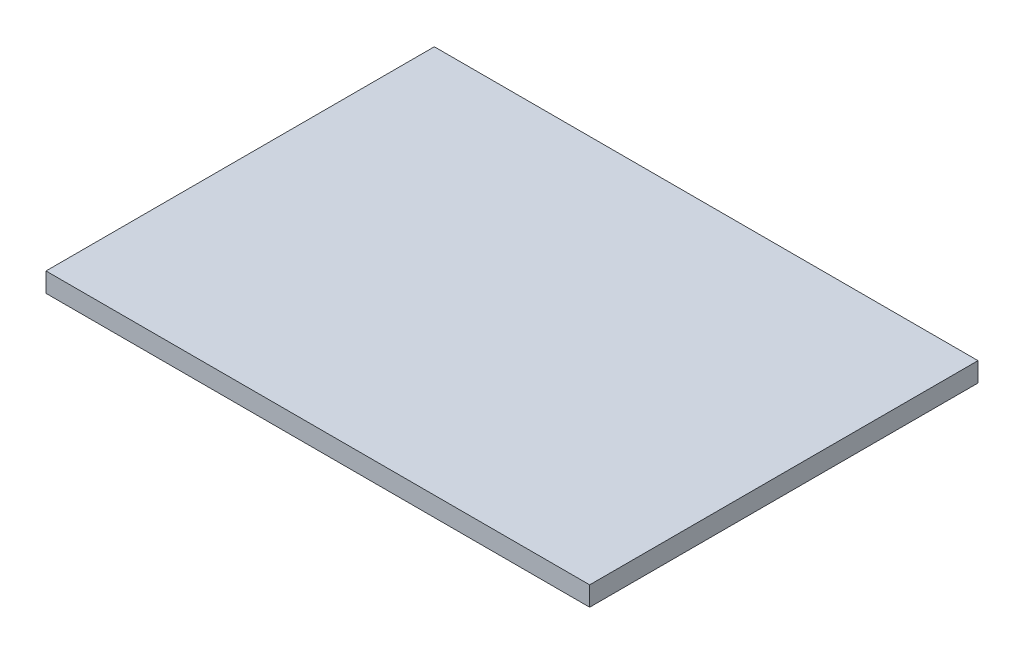
ISO-10303-21;
HEADER;
FILE_DESCRIPTION(('STEP AP214'),'2;1');
FILE_NAME('part.step','',(''),(''),'','','');
FILE_SCHEMA(('AUTOMOTIVE_DESIGN { 1 0 10303 214 1 1 1 1 }'));
ENDSEC;
DATA;
#1=APPLICATION_CONTEXT('core data for automotive mechanical design processes');
#2=APPLICATION_PROTOCOL_DEFINITION('international standard','automotive_design',2000,#1);
#3=PRODUCT_CONTEXT('',#1,'mechanical');
#4=PRODUCT('Part','Part','',(#3));
#5=PRODUCT_RELATED_PRODUCT_CATEGORY('part','',(#4));
#6=PRODUCT_DEFINITION_FORMATION('','',#4);
#7=PRODUCT_DEFINITION_CONTEXT('part definition',#1,'design');
#8=PRODUCT_DEFINITION('design','',#6,#7);
#9=PRODUCT_DEFINITION_SHAPE('','',#8);
#10=(LENGTH_UNIT() NAMED_UNIT(*) SI_UNIT(.MILLI.,.METRE.));
#11=(NAMED_UNIT(*) PLANE_ANGLE_UNIT() SI_UNIT($,.RADIAN.));
#12=(NAMED_UNIT(*) SI_UNIT($,.STERADIAN.) SOLID_ANGLE_UNIT());
#13=UNCERTAINTY_MEASURE_WITH_UNIT(LENGTH_MEASURE(1.E-05),#10,'distance_accuracy_value','');
#14=(GEOMETRIC_REPRESENTATION_CONTEXT(3) GLOBAL_UNCERTAINTY_ASSIGNED_CONTEXT((#13)) GLOBAL_UNIT_ASSIGNED_CONTEXT((#10,
#11,#12)) REPRESENTATION_CONTEXT('',''));
#15=CARTESIAN_POINT('',(0.,0.,0.));
#16=DIRECTION('',(0.,0.,1.));
#17=DIRECTION('',(1.,0.,0.));
#18=AXIS2_PLACEMENT_3D('',#15,#16,#17);
#19=CARTESIAN_POINT('',(177.8,12.7,-127.));
#20=DIRECTION('',(-1.,0.,0.));
#21=DIRECTION('',(0.,0.,1.));
#22=AXIS2_PLACEMENT_3D('',#19,#20,#21);
#23=PLANE('',#22);
#24=DIRECTION('',(0.,0.,-1.));
#25=VECTOR('',#24,1.);
#26=CARTESIAN_POINT('',(177.8,0.,-127.));
#27=LINE('',#26,#25);
#28=CARTESIAN_POINT('',(177.8,0.,127.));
#29=VERTEX_POINT('',#28);
#30=CARTESIAN_POINT('',(177.8,0.,-127.));
#31=VERTEX_POINT('',#30);
#32=EDGE_CURVE('E96',#29,#31,#27,.T.);
#33=ORIENTED_EDGE('',*,*,#32,.T.);
#34=DIRECTION('',(0.,-1.,0.));
#35=VECTOR('',#34,1.);
#36=CARTESIAN_POINT('',(177.8,12.7,-127.));
#37=LINE('',#36,#35);
#38=CARTESIAN_POINT('',(177.8,12.7,-127.));
#39=VERTEX_POINT('',#38);
#40=EDGE_CURVE('E11',#39,#31,#37,.T.);
#41=ORIENTED_EDGE('',*,*,#40,.F.);
#42=DIRECTION('',(0.,0.,-1.));
#43=VECTOR('',#42,1.);
#44=CARTESIAN_POINT('',(177.8,12.7,-127.));
#45=LINE('',#44,#43);
#46=CARTESIAN_POINT('',(177.8,12.7,127.));
#47=VERTEX_POINT('',#46);
#48=EDGE_CURVE('E84',#47,#39,#45,.T.);
#49=ORIENTED_EDGE('',*,*,#48,.F.);
#50=DIRECTION('',(0.,-1.,0.));
#51=VECTOR('',#50,1.);
#52=CARTESIAN_POINT('',(177.8,12.7,127.));
#53=LINE('',#52,#51);
#54=EDGE_CURVE('E92',#47,#29,#53,.T.);
#55=ORIENTED_EDGE('',*,*,#54,.T.);
#56=EDGE_LOOP('',(#33,#41,#49,#55));
#57=FACE_BOUND('',#56,.T.);
#58=ADVANCED_FACE('F33',(#57),#23,.F.);
#59=CARTESIAN_POINT('',(-177.8,12.7,-127.));
#60=DIRECTION('',(0.,0.,1.));
#61=DIRECTION('',(1.,0.,0.));
#62=AXIS2_PLACEMENT_3D('',#59,#60,#61);
#63=PLANE('',#62);
#64=DIRECTION('',(-1.,0.,0.));
#65=VECTOR('',#64,1.);
#66=CARTESIAN_POINT('',(-177.8,0.,-127.));
#67=LINE('',#66,#65);
#68=CARTESIAN_POINT('',(-177.8,0.,-127.));
#69=VERTEX_POINT('',#68);
#70=EDGE_CURVE('E88',#31,#69,#67,.T.);
#71=ORIENTED_EDGE('',*,*,#70,.T.);
#72=DIRECTION('',(0.,-1.,0.));
#73=VECTOR('',#72,1.);
#74=CARTESIAN_POINT('',(-177.8,12.7,-127.));
#75=LINE('',#74,#73);
#76=CARTESIAN_POINT('',(-177.8,12.7,-127.));
#77=VERTEX_POINT('',#76);
#78=EDGE_CURVE('E41',#77,#69,#75,.T.);
#79=ORIENTED_EDGE('',*,*,#78,.F.);
#80=DIRECTION('',(-1.,0.,0.));
#81=VECTOR('',#80,1.);
#82=CARTESIAN_POINT('',(-177.8,12.7,-127.));
#83=LINE('',#82,#81);
#84=EDGE_CURVE('E79',#39,#77,#83,.T.);
#85=ORIENTED_EDGE('',*,*,#84,.F.);
#86=ORIENTED_EDGE('',*,*,#40,.T.);
#87=EDGE_LOOP('',(#71,#79,#85,#86));
#88=FACE_BOUND('',#87,.T.);
#89=ADVANCED_FACE('F87',(#88),#63,.F.);
#90=CARTESIAN_POINT('',(-177.8,12.7,-127.));
#91=DIRECTION('',(1.,0.,0.));
#92=DIRECTION('',(0.,0.,-1.));
#93=AXIS2_PLACEMENT_3D('',#90,#91,#92);
#94=PLANE('',#93);
#95=DIRECTION('',(0.,0.,1.));
#96=VECTOR('',#95,1.);
#97=CARTESIAN_POINT('',(-177.8,0.,-127.));
#98=LINE('',#97,#96);
#99=CARTESIAN_POINT('',(-177.8,0.,127.));
#100=VERTEX_POINT('',#99);
#101=EDGE_CURVE('E66',#69,#100,#98,.T.);
#102=ORIENTED_EDGE('',*,*,#101,.T.);
#103=DIRECTION('',(0.,-1.,0.));
#104=VECTOR('',#103,1.);
#105=CARTESIAN_POINT('',(-177.8,12.7,127.));
#106=LINE('',#105,#104);
#107=CARTESIAN_POINT('',(-177.8,12.7,127.));
#108=VERTEX_POINT('',#107);
#109=EDGE_CURVE('E89',#108,#100,#106,.T.);
#110=ORIENTED_EDGE('',*,*,#109,.F.);
#111=DIRECTION('',(0.,0.,1.));
#112=VECTOR('',#111,1.);
#113=CARTESIAN_POINT('',(-177.8,12.7,-127.));
#114=LINE('',#113,#112);
#115=EDGE_CURVE('E82',#77,#108,#114,.T.);
#116=ORIENTED_EDGE('',*,*,#115,.F.);
#117=ORIENTED_EDGE('',*,*,#78,.T.);
#118=EDGE_LOOP('',(#102,#110,#116,#117));
#119=FACE_BOUND('',#118,.T.);
#120=ADVANCED_FACE('F90',(#119),#94,.F.);
#121=CARTESIAN_POINT('',(-177.8,12.7,127.));
#122=DIRECTION('',(0.,0.,-1.));
#123=DIRECTION('',(-1.,0.,0.));
#124=AXIS2_PLACEMENT_3D('',#121,#122,#123);
#125=PLANE('',#124);
#126=DIRECTION('',(1.,0.,0.));
#127=VECTOR('',#126,1.);
#128=CARTESIAN_POINT('',(-177.8,0.,127.));
#129=LINE('',#128,#127);
#130=EDGE_CURVE('E72',#100,#29,#129,.T.);
#131=ORIENTED_EDGE('',*,*,#130,.T.);
#132=ORIENTED_EDGE('',*,*,#54,.F.);
#133=DIRECTION('',(1.,0.,0.));
#134=VECTOR('',#133,1.);
#135=CARTESIAN_POINT('',(-177.8,12.7,127.));
#136=LINE('',#135,#134);
#137=EDGE_CURVE('E49',#108,#47,#136,.T.);
#138=ORIENTED_EDGE('',*,*,#137,.F.);
#139=ORIENTED_EDGE('',*,*,#109,.T.);
#140=EDGE_LOOP('',(#131,#132,#138,#139));
#141=FACE_BOUND('',#140,.T.);
#142=ADVANCED_FACE('F103',(#141),#125,.F.);
#143=CARTESIAN_POINT('',(0.,12.7,0.));
#144=DIRECTION('',(0.,1.,0.));
#145=DIRECTION('',(0.,0.,1.));
#146=AXIS2_PLACEMENT_3D('',#143,#144,#145);
#147=PLANE('',#146);
#148=ORIENTED_EDGE('',*,*,#48,.T.);
#149=ORIENTED_EDGE('',*,*,#84,.T.);
#150=ORIENTED_EDGE('',*,*,#115,.T.);
#151=ORIENTED_EDGE('',*,*,#137,.T.);
#152=EDGE_LOOP('',(#148,#149,#150,#151));
#153=FACE_BOUND('',#152,.T.);
#154=ADVANCED_FACE('F80',(#153),#147,.T.);
#155=CARTESIAN_POINT('',(0.,0.,0.));
#156=DIRECTION('',(0.,1.,0.));
#157=DIRECTION('',(0.,0.,1.));
#158=AXIS2_PLACEMENT_3D('',#155,#156,#157);
#159=PLANE('',#158);
#160=ORIENTED_EDGE('',*,*,#32,.F.);
#161=ORIENTED_EDGE('',*,*,#130,.F.);
#162=ORIENTED_EDGE('',*,*,#101,.F.);
#163=ORIENTED_EDGE('',*,*,#70,.F.);
#164=EDGE_LOOP('',(#160,#161,#162,#163));
#165=FACE_BOUND('',#164,.T.);
#166=ADVANCED_FACE('F106',(#165),#159,.F.);
#167=CLOSED_SHELL('',(#58,#89,#120,#142,#154,#166));
#168=MANIFOLD_SOLID_BREP('B2',#167);
#169=ADVANCED_BREP_SHAPE_REPRESENTATION('',(#18,#168),#14);
#170=SHAPE_DEFINITION_REPRESENTATION(#9,#169);
ENDSEC;
END-ISO-10303-21;
